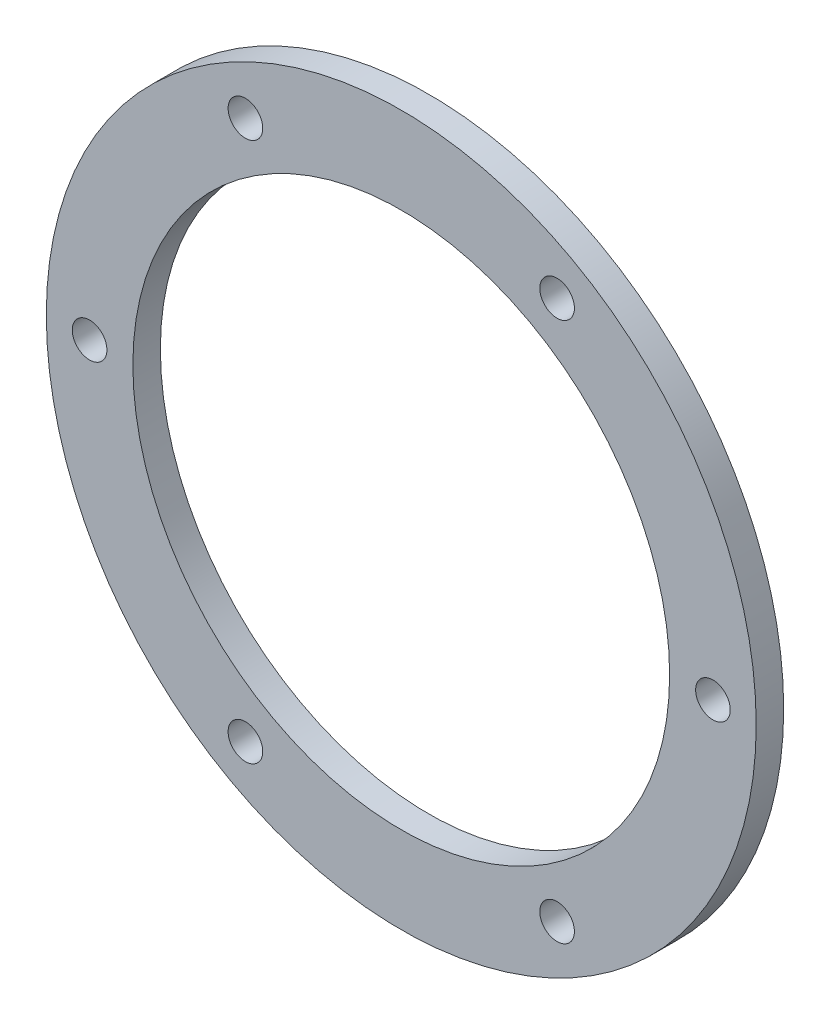
ISO-10303-21;
HEADER;
FILE_DESCRIPTION(('STEP AP214'),'2;1');
FILE_NAME('part.step','',(''),(''),'','','');
FILE_SCHEMA(('AUTOMOTIVE_DESIGN { 1 0 10303 214 1 1 1 1 }'));
ENDSEC;
DATA;
#1=APPLICATION_CONTEXT('core data for automotive mechanical design processes');
#2=APPLICATION_PROTOCOL_DEFINITION('international standard','automotive_design',2000,#1);
#3=PRODUCT_CONTEXT('',#1,'mechanical');
#4=PRODUCT('Part','Part','',(#3));
#5=PRODUCT_RELATED_PRODUCT_CATEGORY('part','',(#4));
#6=PRODUCT_DEFINITION_FORMATION('','',#4);
#7=PRODUCT_DEFINITION_CONTEXT('part definition',#1,'design');
#8=PRODUCT_DEFINITION('design','',#6,#7);
#9=PRODUCT_DEFINITION_SHAPE('','',#8);
#10=(LENGTH_UNIT() NAMED_UNIT(*) SI_UNIT(.MILLI.,.METRE.));
#11=(NAMED_UNIT(*) PLANE_ANGLE_UNIT() SI_UNIT($,.RADIAN.));
#12=(NAMED_UNIT(*) SI_UNIT($,.STERADIAN.) SOLID_ANGLE_UNIT());
#13=UNCERTAINTY_MEASURE_WITH_UNIT(LENGTH_MEASURE(1.E-05),#10,'distance_accuracy_value','');
#14=(GEOMETRIC_REPRESENTATION_CONTEXT(3) GLOBAL_UNCERTAINTY_ASSIGNED_CONTEXT((#13)) GLOBAL_UNIT_ASSIGNED_CONTEXT((#10,
#11,#12)) REPRESENTATION_CONTEXT('',''));
#15=CARTESIAN_POINT('',(0.,0.,0.));
#16=DIRECTION('',(0.,0.,1.));
#17=DIRECTION('',(1.,0.,0.));
#18=AXIS2_PLACEMENT_3D('',#15,#16,#17);
#19=CARTESIAN_POINT('',(0.,0.,3.175));
#20=DIRECTION('',(0.,0.,1.));
#21=DIRECTION('',(1.,0.,0.));
#22=AXIS2_PLACEMENT_3D('',#19,#20,#21);
#23=PLANE('',#22);
#24=CARTESIAN_POINT('',(-35.9999999999979,-1.28307327076601E-12,3.175));
#25=DIRECTION('',(0.,0.,1.));
#26=DIRECTION('',(1.,0.,0.));
#27=AXIS2_PLACEMENT_3D('',#24,#25,#26);
#28=CIRCLE('',#27,2.);
#29=CARTESIAN_POINT('',(-33.9999999999979,-1.28307327076601E-12,3.175));
#30=VERTEX_POINT('',#29);
#31=EDGE_CURVE('E79',#30,#30,#28,.T.);
#32=ORIENTED_EDGE('',*,*,#31,.F.);
#33=EDGE_LOOP('',(#32));
#34=FACE_BOUND('',#33,.T.);
#35=CARTESIAN_POINT('',(-17.9999999999958,-31.1769145362398,3.175));
#36=DIRECTION('',(0.,0.,1.));
#37=DIRECTION('',(1.,0.,0.));
#38=AXIS2_PLACEMENT_3D('',#35,#36,#37);
#39=CIRCLE('',#38,2.);
#40=CARTESIAN_POINT('',(-15.9999999999958,-31.1769145362398,3.175));
#41=VERTEX_POINT('',#40);
#42=EDGE_CURVE('E73',#41,#41,#39,.T.);
#43=ORIENTED_EDGE('',*,*,#42,.F.);
#44=EDGE_LOOP('',(#43));
#45=FACE_BOUND('',#44,.T.);
#46=CARTESIAN_POINT('',(18.0000000000042,-31.1769145362374,3.175));
#47=DIRECTION('',(0.,0.,1.));
#48=DIRECTION('',(1.,0.,0.));
#49=AXIS2_PLACEMENT_3D('',#46,#47,#48);
#50=CIRCLE('',#49,2.);
#51=CARTESIAN_POINT('',(20.0000000000042,-31.1769145362374,3.175));
#52=VERTEX_POINT('',#51);
#53=EDGE_CURVE('E67',#52,#52,#50,.T.);
#54=ORIENTED_EDGE('',*,*,#53,.F.);
#55=EDGE_LOOP('',(#54));
#56=FACE_BOUND('',#55,.T.);
#57=CARTESIAN_POINT('',(36.0000000000021,3.64735229072368E-12,3.175));
#58=DIRECTION('',(0.,0.,1.));
#59=DIRECTION('',(1.,0.,0.));
#60=AXIS2_PLACEMENT_3D('',#57,#58,#59);
#61=CIRCLE('',#60,2.);
#62=CARTESIAN_POINT('',(38.0000000000021,3.64735229072368E-12,3.175));
#63=VERTEX_POINT('',#62);
#64=EDGE_CURVE('E61',#63,#63,#61,.T.);
#65=ORIENTED_EDGE('',*,*,#64,.F.);
#66=EDGE_LOOP('',(#65));
#67=FACE_BOUND('',#66,.T.);
#68=CARTESIAN_POINT('',(18.,31.1769145362422,3.175));
#69=DIRECTION('',(0.,0.,1.));
#70=DIRECTION('',(1.,0.,0.));
#71=AXIS2_PLACEMENT_3D('',#68,#69,#70);
#72=CIRCLE('',#71,2.);
#73=CARTESIAN_POINT('',(20.,31.1769145362422,3.175));
#74=VERTEX_POINT('',#73);
#75=EDGE_CURVE('E55',#74,#74,#72,.T.);
#76=ORIENTED_EDGE('',*,*,#75,.F.);
#77=EDGE_LOOP('',(#76));
#78=FACE_BOUND('',#77,.T.);
#79=CARTESIAN_POINT('',(-18.,31.1769145362398,3.175));
#80=DIRECTION('',(0.,0.,1.));
#81=DIRECTION('',(1.,0.,0.));
#82=AXIS2_PLACEMENT_3D('',#79,#80,#81);
#83=CIRCLE('',#82,2.);
#84=CARTESIAN_POINT('',(-16.,31.1769145362398,3.175));
#85=VERTEX_POINT('',#84);
#86=EDGE_CURVE('E49',#85,#85,#83,.T.);
#87=ORIENTED_EDGE('',*,*,#86,.F.);
#88=EDGE_LOOP('',(#87));
#89=FACE_BOUND('',#88,.T.);
#90=CARTESIAN_POINT('',(0.,0.,3.175));
#91=DIRECTION('',(0.,0.,1.));
#92=DIRECTION('',(1.,0.,0.));
#93=AXIS2_PLACEMENT_3D('',#90,#91,#92);
#94=CIRCLE('',#93,41.);
#95=CARTESIAN_POINT('',(41.,0.,3.175));
#96=VERTEX_POINT('',#95);
#97=EDGE_CURVE('E10',#96,#96,#94,.T.);
#98=ORIENTED_EDGE('',*,*,#97,.T.);
#99=EDGE_LOOP('',(#98));
#100=FACE_BOUND('',#99,.T.);
#101=CARTESIAN_POINT('',(0.,0.,3.175));
#102=DIRECTION('',(0.,0.,1.));
#103=DIRECTION('',(1.,0.,0.));
#104=AXIS2_PLACEMENT_3D('',#101,#102,#103);
#105=CIRCLE('',#104,31.);
#106=CARTESIAN_POINT('',(31.,0.,3.175));
#107=VERTEX_POINT('',#106);
#108=EDGE_CURVE('E41',#107,#107,#105,.T.);
#109=ORIENTED_EDGE('',*,*,#108,.F.);
#110=EDGE_LOOP('',(#109));
#111=FACE_BOUND('',#110,.T.);
#112=ADVANCED_FACE('F30',(#34,#45,#56,#67,#78,#89,#100,#111),#23,.T.);
#113=CARTESIAN_POINT('',(0.,0.,0.));
#114=DIRECTION('',(0.,0.,1.));
#115=DIRECTION('',(1.,0.,0.));
#116=AXIS2_PLACEMENT_3D('',#113,#114,#115);
#117=PLANE('',#116);
#118=CARTESIAN_POINT('',(-35.9999999999979,-1.28307327076601E-12,0.));
#119=DIRECTION('',(0.,0.,1.));
#120=DIRECTION('',(1.,0.,0.));
#121=AXIS2_PLACEMENT_3D('',#118,#119,#120);
#122=CIRCLE('',#121,2.);
#123=CARTESIAN_POINT('',(-33.9999999999979,-1.28307327076601E-12,0.));
#124=VERTEX_POINT('',#123);
#125=EDGE_CURVE('E76',#124,#124,#122,.T.);
#126=ORIENTED_EDGE('',*,*,#125,.T.);
#127=EDGE_LOOP('',(#126));
#128=FACE_BOUND('',#127,.T.);
#129=CARTESIAN_POINT('',(-17.9999999999958,-31.1769145362398,0.));
#130=DIRECTION('',(0.,0.,1.));
#131=DIRECTION('',(1.,0.,0.));
#132=AXIS2_PLACEMENT_3D('',#129,#130,#131);
#133=CIRCLE('',#132,2.);
#134=CARTESIAN_POINT('',(-15.9999999999958,-31.1769145362398,0.));
#135=VERTEX_POINT('',#134);
#136=EDGE_CURVE('E70',#135,#135,#133,.T.);
#137=ORIENTED_EDGE('',*,*,#136,.T.);
#138=EDGE_LOOP('',(#137));
#139=FACE_BOUND('',#138,.T.);
#140=CARTESIAN_POINT('',(18.0000000000042,-31.1769145362374,0.));
#141=DIRECTION('',(0.,0.,1.));
#142=DIRECTION('',(1.,0.,0.));
#143=AXIS2_PLACEMENT_3D('',#140,#141,#142);
#144=CIRCLE('',#143,2.);
#145=CARTESIAN_POINT('',(20.0000000000042,-31.1769145362374,0.));
#146=VERTEX_POINT('',#145);
#147=EDGE_CURVE('E64',#146,#146,#144,.T.);
#148=ORIENTED_EDGE('',*,*,#147,.T.);
#149=EDGE_LOOP('',(#148));
#150=FACE_BOUND('',#149,.T.);
#151=CARTESIAN_POINT('',(36.0000000000021,3.64735229072368E-12,0.));
#152=DIRECTION('',(0.,0.,1.));
#153=DIRECTION('',(1.,0.,0.));
#154=AXIS2_PLACEMENT_3D('',#151,#152,#153);
#155=CIRCLE('',#154,2.);
#156=CARTESIAN_POINT('',(38.0000000000021,3.64735229072368E-12,0.));
#157=VERTEX_POINT('',#156);
#158=EDGE_CURVE('E58',#157,#157,#155,.T.);
#159=ORIENTED_EDGE('',*,*,#158,.T.);
#160=EDGE_LOOP('',(#159));
#161=FACE_BOUND('',#160,.T.);
#162=CARTESIAN_POINT('',(18.,31.1769145362422,0.));
#163=DIRECTION('',(0.,0.,1.));
#164=DIRECTION('',(1.,0.,0.));
#165=AXIS2_PLACEMENT_3D('',#162,#163,#164);
#166=CIRCLE('',#165,2.);
#167=CARTESIAN_POINT('',(20.,31.1769145362422,0.));
#168=VERTEX_POINT('',#167);
#169=EDGE_CURVE('E52',#168,#168,#166,.T.);
#170=ORIENTED_EDGE('',*,*,#169,.T.);
#171=EDGE_LOOP('',(#170));
#172=FACE_BOUND('',#171,.T.);
#173=CARTESIAN_POINT('',(-18.,31.1769145362398,0.));
#174=DIRECTION('',(0.,0.,1.));
#175=DIRECTION('',(1.,0.,0.));
#176=AXIS2_PLACEMENT_3D('',#173,#174,#175);
#177=CIRCLE('',#176,2.);
#178=CARTESIAN_POINT('',(-16.,31.1769145362398,0.));
#179=VERTEX_POINT('',#178);
#180=EDGE_CURVE('E46',#179,#179,#177,.T.);
#181=ORIENTED_EDGE('',*,*,#180,.T.);
#182=EDGE_LOOP('',(#181));
#183=FACE_BOUND('',#182,.T.);
#184=CARTESIAN_POINT('',(0.,0.,0.));
#185=DIRECTION('',(0.,0.,1.));
#186=DIRECTION('',(1.,0.,0.));
#187=AXIS2_PLACEMENT_3D('',#184,#185,#186);
#188=CIRCLE('',#187,41.);
#189=CARTESIAN_POINT('',(41.,0.,0.));
#190=VERTEX_POINT('',#189);
#191=EDGE_CURVE('E34',#190,#190,#188,.T.);
#192=ORIENTED_EDGE('',*,*,#191,.F.);
#193=EDGE_LOOP('',(#192));
#194=FACE_BOUND('',#193,.T.);
#195=CARTESIAN_POINT('',(0.,0.,0.));
#196=DIRECTION('',(0.,0.,1.));
#197=DIRECTION('',(1.,0.,0.));
#198=AXIS2_PLACEMENT_3D('',#195,#196,#197);
#199=CIRCLE('',#198,31.);
#200=CARTESIAN_POINT('',(31.,0.,0.));
#201=VERTEX_POINT('',#200);
#202=EDGE_CURVE('E43',#201,#201,#199,.T.);
#203=ORIENTED_EDGE('',*,*,#202,.T.);
#204=EDGE_LOOP('',(#203));
#205=FACE_BOUND('',#204,.T.);
#206=ADVANCED_FACE('F85',(#128,#139,#150,#161,#172,#183,#194,#205),#117,.F.);
#207=CARTESIAN_POINT('',(0.,0.,3.175));
#208=DIRECTION('',(0.,0.,-1.));
#209=DIRECTION('',(-1.,0.,0.));
#210=AXIS2_PLACEMENT_3D('',#207,#208,#209);
#211=CYLINDRICAL_SURFACE('',#210,41.);
#212=ORIENTED_EDGE('',*,*,#97,.F.);
#213=EDGE_LOOP('',(#212));
#214=FACE_BOUND('',#213,.T.);
#215=ORIENTED_EDGE('',*,*,#191,.T.);
#216=EDGE_LOOP('',(#215));
#217=FACE_BOUND('',#216,.T.);
#218=ADVANCED_FACE('F32',(#214,#217),#211,.T.);
#219=CARTESIAN_POINT('',(0.,0.,3.175));
#220=DIRECTION('',(0.,0.,-1.));
#221=DIRECTION('',(-1.,0.,0.));
#222=AXIS2_PLACEMENT_3D('',#219,#220,#221);
#223=CYLINDRICAL_SURFACE('',#222,31.);
#224=ORIENTED_EDGE('',*,*,#108,.T.);
#225=EDGE_LOOP('',(#224));
#226=FACE_BOUND('',#225,.T.);
#227=ORIENTED_EDGE('',*,*,#202,.F.);
#228=EDGE_LOOP('',(#227));
#229=FACE_BOUND('',#228,.T.);
#230=ADVANCED_FACE('F110',(#226,#229),#223,.F.);
#231=CARTESIAN_POINT('',(-18.,31.1769145362398,0.));
#232=DIRECTION('',(0.,0.,1.));
#233=DIRECTION('',(1.,0.,0.));
#234=AXIS2_PLACEMENT_3D('',#231,#232,#233);
#235=CYLINDRICAL_SURFACE('',#234,2.);
#236=ORIENTED_EDGE('',*,*,#180,.F.);
#237=EDGE_LOOP('',(#236));
#238=FACE_BOUND('',#237,.T.);
#239=ORIENTED_EDGE('',*,*,#86,.T.);
#240=EDGE_LOOP('',(#239));
#241=FACE_BOUND('',#240,.T.);
#242=ADVANCED_FACE('F113',(#238,#241),#235,.F.);
#243=CARTESIAN_POINT('',(18.,31.1769145362422,0.));
#244=DIRECTION('',(0.,0.,1.));
#245=DIRECTION('',(1.,0.,0.));
#246=AXIS2_PLACEMENT_3D('',#243,#244,#245);
#247=CYLINDRICAL_SURFACE('',#246,2.);
#248=ORIENTED_EDGE('',*,*,#169,.F.);
#249=EDGE_LOOP('',(#248));
#250=FACE_BOUND('',#249,.T.);
#251=ORIENTED_EDGE('',*,*,#75,.T.);
#252=EDGE_LOOP('',(#251));
#253=FACE_BOUND('',#252,.T.);
#254=ADVANCED_FACE('F125',(#250,#253),#247,.F.);
#255=CARTESIAN_POINT('',(36.0000000000021,3.64735229072368E-12,0.));
#256=DIRECTION('',(0.,0.,1.));
#257=DIRECTION('',(1.,0.,0.));
#258=AXIS2_PLACEMENT_3D('',#255,#256,#257);
#259=CYLINDRICAL_SURFACE('',#258,2.);
#260=ORIENTED_EDGE('',*,*,#158,.F.);
#261=EDGE_LOOP('',(#260));
#262=FACE_BOUND('',#261,.T.);
#263=ORIENTED_EDGE('',*,*,#64,.T.);
#264=EDGE_LOOP('',(#263));
#265=FACE_BOUND('',#264,.T.);
#266=ADVANCED_FACE('F129',(#262,#265),#259,.F.);
#267=CARTESIAN_POINT('',(18.0000000000042,-31.1769145362374,0.));
#268=DIRECTION('',(0.,0.,1.));
#269=DIRECTION('',(1.,0.,0.));
#270=AXIS2_PLACEMENT_3D('',#267,#268,#269);
#271=CYLINDRICAL_SURFACE('',#270,2.);
#272=ORIENTED_EDGE('',*,*,#147,.F.);
#273=EDGE_LOOP('',(#272));
#274=FACE_BOUND('',#273,.T.);
#275=ORIENTED_EDGE('',*,*,#53,.T.);
#276=EDGE_LOOP('',(#275));
#277=FACE_BOUND('',#276,.T.);
#278=ADVANCED_FACE('F133',(#274,#277),#271,.F.);
#279=CARTESIAN_POINT('',(-17.9999999999958,-31.1769145362398,0.));
#280=DIRECTION('',(0.,0.,1.));
#281=DIRECTION('',(1.,0.,0.));
#282=AXIS2_PLACEMENT_3D('',#279,#280,#281);
#283=CYLINDRICAL_SURFACE('',#282,2.);
#284=ORIENTED_EDGE('',*,*,#136,.F.);
#285=EDGE_LOOP('',(#284));
#286=FACE_BOUND('',#285,.T.);
#287=ORIENTED_EDGE('',*,*,#42,.T.);
#288=EDGE_LOOP('',(#287));
#289=FACE_BOUND('',#288,.T.);
#290=ADVANCED_FACE('F91',(#286,#289),#283,.F.);
#291=CARTESIAN_POINT('',(-35.9999999999979,-1.28307327076601E-12,0.));
#292=DIRECTION('',(0.,0.,1.));
#293=DIRECTION('',(1.,0.,0.));
#294=AXIS2_PLACEMENT_3D('',#291,#292,#293);
#295=CYLINDRICAL_SURFACE('',#294,2.);
#296=ORIENTED_EDGE('',*,*,#125,.F.);
#297=EDGE_LOOP('',(#296));
#298=FACE_BOUND('',#297,.T.);
#299=ORIENTED_EDGE('',*,*,#31,.T.);
#300=EDGE_LOOP('',(#299));
#301=FACE_BOUND('',#300,.T.);
#302=ADVANCED_FACE('F88',(#298,#301),#295,.F.);
#303=CLOSED_SHELL('',(#112,#206,#218,#230,#242,#254,#266,#278,#290,#302));
#304=MANIFOLD_SOLID_BREP('B2',#303);
#305=ADVANCED_BREP_SHAPE_REPRESENTATION('',(#18,#304),#14);
#306=SHAPE_DEFINITION_REPRESENTATION(#9,#305);
ENDSEC;
END-ISO-10303-21;
